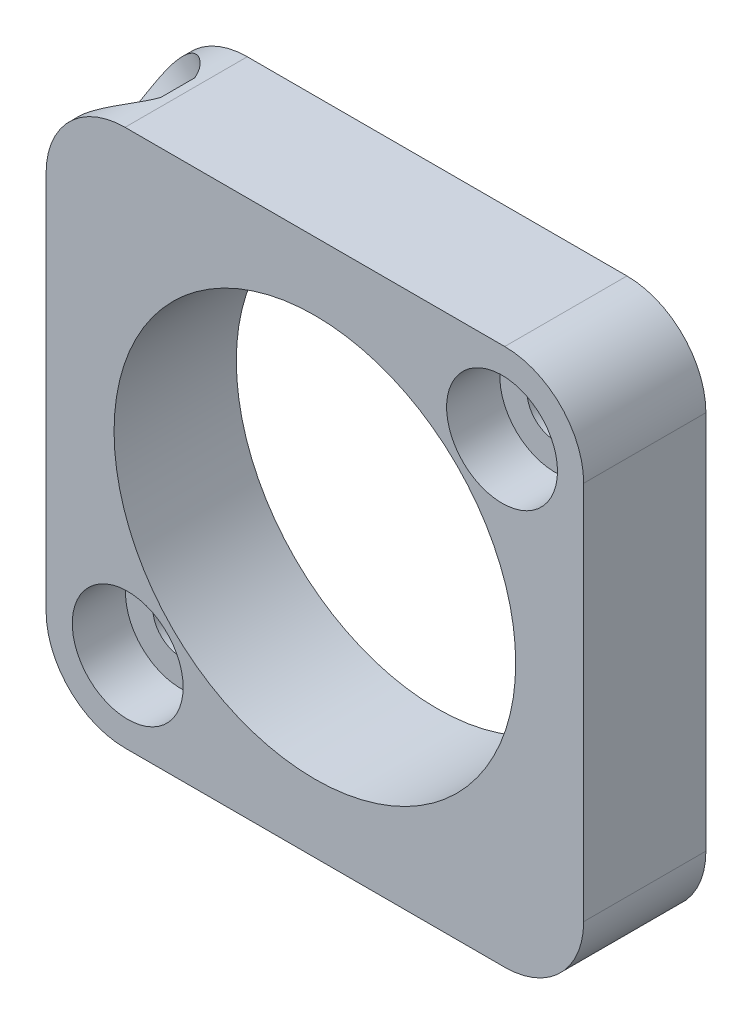
ISO-10303-21;
HEADER;
FILE_DESCRIPTION(('STEP AP214'),'2;1');
FILE_NAME('part.step','',(''),(''),'','','');
FILE_SCHEMA(('AUTOMOTIVE_DESIGN { 1 0 10303 214 1 1 1 1 }'));
ENDSEC;
DATA;
#1=APPLICATION_CONTEXT('core data for automotive mechanical design processes');
#2=APPLICATION_PROTOCOL_DEFINITION('international standard','automotive_design',2000,#1);
#3=PRODUCT_CONTEXT('',#1,'mechanical');
#4=PRODUCT('Part','Part','',(#3));
#5=PRODUCT_RELATED_PRODUCT_CATEGORY('part','',(#4));
#6=PRODUCT_DEFINITION_FORMATION('','',#4);
#7=PRODUCT_DEFINITION_CONTEXT('part definition',#1,'design');
#8=PRODUCT_DEFINITION('design','',#6,#7);
#9=PRODUCT_DEFINITION_SHAPE('','',#8);
#10=(LENGTH_UNIT() NAMED_UNIT(*) SI_UNIT(.MILLI.,.METRE.));
#11=(NAMED_UNIT(*) PLANE_ANGLE_UNIT() SI_UNIT($,.RADIAN.));
#12=(NAMED_UNIT(*) SI_UNIT($,.STERADIAN.) SOLID_ANGLE_UNIT());
#13=UNCERTAINTY_MEASURE_WITH_UNIT(LENGTH_MEASURE(1.E-05),#10,'distance_accuracy_value','');
#14=(GEOMETRIC_REPRESENTATION_CONTEXT(3) GLOBAL_UNCERTAINTY_ASSIGNED_CONTEXT((#13)) GLOBAL_UNIT_ASSIGNED_CONTEXT((#10,
#11,#12)) REPRESENTATION_CONTEXT('',''));
#15=CARTESIAN_POINT('',(0.,0.,0.));
#16=DIRECTION('',(0.,0.,1.));
#17=DIRECTION('',(1.,0.,0.));
#18=AXIS2_PLACEMENT_3D('',#15,#16,#17);
#19=CARTESIAN_POINT('',(0.,5.75,0.));
#20=DIRECTION('',(0.,0.,1.));
#21=DIRECTION('',(1.,0.,0.));
#22=AXIS2_PLACEMENT_3D('',#19,#20,#21);
#23=PLANE('',#22);
#24=CARTESIAN_POINT('',(0.,0.,0.));
#25=DIRECTION('',(0.,0.,1.));
#26=DIRECTION('',(1.,0.,0.));
#27=AXIS2_PLACEMENT_3D('',#24,#25,#26);
#28=CIRCLE('',#27,5.75);
#29=CARTESIAN_POINT('',(5.75,0.,0.));
#30=VERTEX_POINT('',#29);
#31=EDGE_CURVE('E188',#30,#30,#28,.T.);
#32=ORIENTED_EDGE('',*,*,#31,.T.);
#33=EDGE_LOOP('',(#32));
#34=FACE_BOUND('',#33,.T.);
#35=CARTESIAN_POINT('',(-5.35939999916395,-5.35939999916393,0.));
#36=DIRECTION('',(0.,0.,1.));
#37=DIRECTION('',(1.,0.,0.));
#38=AXIS2_PLACEMENT_3D('',#35,#36,#37);
#39=CIRCLE('',#38,1.44145);
#40=CARTESIAN_POINT('',(-3.91794999916395,-5.35939999916393,0.));
#41=VERTEX_POINT('',#40);
#42=EDGE_CURVE('E173',#41,#41,#39,.T.);
#43=ORIENTED_EDGE('',*,*,#42,.T.);
#44=EDGE_LOOP('',(#43));
#45=FACE_BOUND('',#44,.T.);
#46=CARTESIAN_POINT('',(5.35939999916395,5.35939999916392,0.));
#47=DIRECTION('',(0.,0.,1.));
#48=DIRECTION('',(1.,0.,0.));
#49=AXIS2_PLACEMENT_3D('',#46,#47,#48);
#50=CIRCLE('',#49,1.44145);
#51=CARTESIAN_POINT('',(6.80084999916395,5.35939999916392,0.));
#52=VERTEX_POINT('',#51);
#53=EDGE_CURVE('E158',#52,#52,#50,.T.);
#54=ORIENTED_EDGE('',*,*,#53,.T.);
#55=EDGE_LOOP('',(#54));
#56=FACE_BOUND('',#55,.T.);
#57=DIRECTION('',(0.,1.,0.));
#58=VECTOR('',#57,1.);
#59=CARTESIAN_POINT('',(7.6962,5.75,0.));
#60=LINE('',#59,#58);
#61=CARTESIAN_POINT('',(7.6962,-5.4356,0.));
#62=VERTEX_POINT('',#61);
#63=CARTESIAN_POINT('',(7.6962,5.4356,0.));
#64=VERTEX_POINT('',#63);
#65=EDGE_CURVE('E150',#62,#64,#60,.T.);
#66=ORIENTED_EDGE('',*,*,#65,.F.);
#67=CARTESIAN_POINT('',(5.4356,-5.4356,0.));
#68=DIRECTION('',(0.,0.,1.));
#69=DIRECTION('',(1.,0.,0.));
#70=AXIS2_PLACEMENT_3D('',#67,#68,#69);
#71=CIRCLE('',#70,2.2606);
#72=CARTESIAN_POINT('',(5.4356,-7.6962,0.));
#73=VERTEX_POINT('',#72);
#74=EDGE_CURVE('E217',#62,#73,#71,.F.);
#75=ORIENTED_EDGE('',*,*,#74,.T.);
#76=DIRECTION('',(1.,0.,0.));
#77=VECTOR('',#76,1.);
#78=CARTESIAN_POINT('',(0.,-7.6962,0.));
#79=LINE('',#78,#77);
#80=CARTESIAN_POINT('',(-5.4356,-7.6962,0.));
#81=VERTEX_POINT('',#80);
#82=EDGE_CURVE('E147',#81,#73,#79,.T.);
#83=ORIENTED_EDGE('',*,*,#82,.F.);
#84=CARTESIAN_POINT('',(-5.4356,-5.4356,0.));
#85=DIRECTION('',(0.,0.,1.));
#86=DIRECTION('',(1.,0.,0.));
#87=AXIS2_PLACEMENT_3D('',#84,#85,#86);
#88=CIRCLE('',#87,2.2606);
#89=CARTESIAN_POINT('',(-7.6962,-5.4356,0.));
#90=VERTEX_POINT('',#89);
#91=EDGE_CURVE('E215',#81,#90,#88,.F.);
#92=ORIENTED_EDGE('',*,*,#91,.T.);
#93=DIRECTION('',(0.,-1.,0.));
#94=VECTOR('',#93,1.);
#95=CARTESIAN_POINT('',(-7.6962,5.75,0.));
#96=LINE('',#95,#94);
#97=CARTESIAN_POINT('',(-7.6962,5.4356,0.));
#98=VERTEX_POINT('',#97);
#99=EDGE_CURVE('E155',#98,#90,#96,.T.);
#100=ORIENTED_EDGE('',*,*,#99,.F.);
#101=CARTESIAN_POINT('',(-5.4356,5.4356,0.));
#102=DIRECTION('',(0.,0.,1.));
#103=DIRECTION('',(1.,0.,0.));
#104=AXIS2_PLACEMENT_3D('',#101,#102,#103);
#105=CIRCLE('',#104,2.2606);
#106=CARTESIAN_POINT('',(-5.4356,7.6962,0.));
#107=VERTEX_POINT('',#106);
#108=EDGE_CURVE('E58',#98,#107,#105,.F.);
#109=ORIENTED_EDGE('',*,*,#108,.T.);
#110=DIRECTION('',(-1.,0.,0.));
#111=VECTOR('',#110,1.);
#112=CARTESIAN_POINT('',(0.,7.6962,0.));
#113=LINE('',#112,#111);
#114=CARTESIAN_POINT('',(5.4356,7.6962,0.));
#115=VERTEX_POINT('',#114);
#116=EDGE_CURVE('E153',#115,#107,#113,.T.);
#117=ORIENTED_EDGE('',*,*,#116,.F.);
#118=CARTESIAN_POINT('',(5.4356,5.4356,0.));
#119=DIRECTION('',(0.,0.,1.));
#120=DIRECTION('',(1.,0.,0.));
#121=AXIS2_PLACEMENT_3D('',#118,#119,#120);
#122=CIRCLE('',#121,2.2606);
#123=EDGE_CURVE('E212',#115,#64,#122,.F.);
#124=ORIENTED_EDGE('',*,*,#123,.T.);
#125=EDGE_LOOP('',(#66,#75,#83,#92,#100,#109,#117,#124));
#126=FACE_BOUND('',#125,.T.);
#127=ADVANCED_FACE('F35',(#34,#45,#56,#126),#23,.F.);
#128=CARTESIAN_POINT('',(0.,15.,3.5));
#129=DIRECTION('',(0.,0.,-1.));
#130=DIRECTION('',(-1.,0.,0.));
#131=AXIS2_PLACEMENT_3D('',#128,#129,#130);
#132=PLANE('',#131);
#133=CARTESIAN_POINT('',(0.,0.,3.5));
#134=DIRECTION('',(0.,0.,1.));
#135=DIRECTION('',(1.,0.,0.));
#136=AXIS2_PLACEMENT_3D('',#133,#134,#135);
#137=CIRCLE('',#136,5.75);
#138=CARTESIAN_POINT('',(5.75,0.,3.5));
#139=VERTEX_POINT('',#138);
#140=EDGE_CURVE('E191',#139,#139,#137,.T.);
#141=ORIENTED_EDGE('',*,*,#140,.F.);
#142=EDGE_LOOP('',(#141));
#143=FACE_BOUND('',#142,.T.);
#144=CARTESIAN_POINT('',(-5.35939999916395,-5.35939999916393,3.5));
#145=DIRECTION('',(0.,0.,1.));
#146=DIRECTION('',(1.,0.,0.));
#147=AXIS2_PLACEMENT_3D('',#144,#145,#146);
#148=CIRCLE('',#147,1.5875);
#149=CARTESIAN_POINT('',(-3.77189999916395,-5.35939999916393,3.5));
#150=VERTEX_POINT('',#149);
#151=EDGE_CURVE('E176',#150,#150,#148,.T.);
#152=ORIENTED_EDGE('',*,*,#151,.F.);
#153=EDGE_LOOP('',(#152));
#154=FACE_BOUND('',#153,.T.);
#155=CARTESIAN_POINT('',(5.35939999916395,5.35939999916392,3.5));
#156=DIRECTION('',(0.,0.,1.));
#157=DIRECTION('',(1.,0.,0.));
#158=AXIS2_PLACEMENT_3D('',#155,#156,#157);
#159=CIRCLE('',#158,1.5875);
#160=CARTESIAN_POINT('',(6.94689999916395,5.35939999916392,3.5));
#161=VERTEX_POINT('',#160);
#162=EDGE_CURVE('E161',#161,#161,#159,.T.);
#163=ORIENTED_EDGE('',*,*,#162,.F.);
#164=EDGE_LOOP('',(#163));
#165=FACE_BOUND('',#164,.T.);
#166=DIRECTION('',(1.,0.,0.));
#167=VECTOR('',#166,1.);
#168=CARTESIAN_POINT('',(-7.6962,-7.6962,3.5));
#169=LINE('',#168,#167);
#170=CARTESIAN_POINT('',(-5.4356,-7.6962,3.5));
#171=VERTEX_POINT('',#170);
#172=CARTESIAN_POINT('',(5.4356,-7.6962,3.5));
#173=VERTEX_POINT('',#172);
#174=EDGE_CURVE('E129',#171,#173,#169,.T.);
#175=ORIENTED_EDGE('',*,*,#174,.T.);
#176=CARTESIAN_POINT('',(5.4356,-5.4356,3.5));
#177=DIRECTION('',(0.,0.,-1.));
#178=DIRECTION('',(-1.,0.,0.));
#179=AXIS2_PLACEMENT_3D('',#176,#177,#178);
#180=CIRCLE('',#179,2.2606);
#181=CARTESIAN_POINT('',(7.6962,-5.4356,3.5));
#182=VERTEX_POINT('',#181);
#183=EDGE_CURVE('E205',#173,#182,#180,.F.);
#184=ORIENTED_EDGE('',*,*,#183,.T.);
#185=DIRECTION('',(0.,1.,0.));
#186=VECTOR('',#185,1.);
#187=CARTESIAN_POINT('',(7.6962,7.6962,3.5));
#188=LINE('',#187,#186);
#189=CARTESIAN_POINT('',(7.6962,5.4356,3.5));
#190=VERTEX_POINT('',#189);
#191=EDGE_CURVE('E141',#182,#190,#188,.T.);
#192=ORIENTED_EDGE('',*,*,#191,.T.);
#193=CARTESIAN_POINT('',(5.4356,5.4356,3.5));
#194=DIRECTION('',(0.,0.,-1.));
#195=DIRECTION('',(-1.,0.,0.));
#196=AXIS2_PLACEMENT_3D('',#193,#194,#195);
#197=CIRCLE('',#196,2.2606);
#198=CARTESIAN_POINT('',(5.4356,7.6962,3.5));
#199=VERTEX_POINT('',#198);
#200=EDGE_CURVE('E199',#190,#199,#197,.F.);
#201=ORIENTED_EDGE('',*,*,#200,.T.);
#202=DIRECTION('',(-1.,0.,0.));
#203=VECTOR('',#202,1.);
#204=CARTESIAN_POINT('',(-7.6962,7.6962,3.5));
#205=LINE('',#204,#203);
#206=CARTESIAN_POINT('',(-5.4356,7.6962,3.5));
#207=VERTEX_POINT('',#206);
#208=EDGE_CURVE('E144',#199,#207,#205,.T.);
#209=ORIENTED_EDGE('',*,*,#208,.T.);
#210=CARTESIAN_POINT('',(-5.4356,5.4356,3.5));
#211=DIRECTION('',(0.,0.,-1.));
#212=DIRECTION('',(-1.,0.,0.));
#213=AXIS2_PLACEMENT_3D('',#210,#211,#212);
#214=CIRCLE('',#213,2.2606);
#215=CARTESIAN_POINT('',(-7.6962,5.4356,3.5));
#216=VERTEX_POINT('',#215);
#217=EDGE_CURVE('E201',#207,#216,#214,.F.);
#218=ORIENTED_EDGE('',*,*,#217,.T.);
#219=DIRECTION('',(0.,-1.,0.));
#220=VECTOR('',#219,1.);
#221=CARTESIAN_POINT('',(-7.6962,7.6962,3.5));
#222=LINE('',#221,#220);
#223=CARTESIAN_POINT('',(-7.6962,-5.4356,3.5));
#224=VERTEX_POINT('',#223);
#225=EDGE_CURVE('E126',#216,#224,#222,.T.);
#226=ORIENTED_EDGE('',*,*,#225,.T.);
#227=CARTESIAN_POINT('',(-5.4356,-5.4356,3.5));
#228=DIRECTION('',(0.,0.,-1.));
#229=DIRECTION('',(-1.,0.,0.));
#230=AXIS2_PLACEMENT_3D('',#227,#228,#229);
#231=CIRCLE('',#230,2.2606);
#232=EDGE_CURVE('E203',#224,#171,#231,.F.);
#233=ORIENTED_EDGE('',*,*,#232,.T.);
#234=EDGE_LOOP('',(#175,#184,#192,#201,#209,#218,#226,#233));
#235=FACE_BOUND('',#234,.T.);
#236=ADVANCED_FACE('F297',(#143,#154,#165,#235),#132,.F.);
#237=CARTESIAN_POINT('',(0.,0.,0.));
#238=DIRECTION('',(0.,0.,1.));
#239=DIRECTION('',(1.,0.,0.));
#240=AXIS2_PLACEMENT_3D('',#237,#238,#239);
#241=CYLINDRICAL_SURFACE('',#240,5.75);
#242=CARTESIAN_POINT('',(-4.64559309643393,3.38835723948425,1.75));
#243=CARTESIAN_POINT('',(-4.64559225748131,3.38835927889538,1.79961428160127));
#244=CARTESIAN_POINT('',(-4.64311084036011,3.39176863705336,1.8492569100176));
#245=CARTESIAN_POINT('',(-4.63321514723789,3.40527308647253,1.9471529006297));
#246=CARTESIAN_POINT('',(-4.6257961296468,3.4153746041886,1.99540488086897));
#247=CARTESIAN_POINT('',(-4.60613892464953,3.44183876247575,2.08908845166155));
#248=CARTESIAN_POINT('',(-4.59390452306584,3.45819648417631,2.13452222546536));
#249=CARTESIAN_POINT('',(-4.5647998059507,3.49652385633229,2.22134650809414));
#250=CARTESIAN_POINT('',(-4.5479300974749,3.51849277190003,2.26273754540823));
#251=CARTESIAN_POINT('',(-4.50966676812324,3.56740442139802,2.34065918292924));
#252=CARTESIAN_POINT('',(-4.48823973255348,3.59438369541901,2.37715044360766));
#253=CARTESIAN_POINT('',(-4.44129760660957,3.65222674738696,2.44389555512867));
#254=CARTESIAN_POINT('',(-4.41578228703176,3.68309074310436,2.47414905604279));
#255=CARTESIAN_POINT('',(-4.36100010269594,3.74779688231351,2.5277056985334));
#256=CARTESIAN_POINT('',(-4.33171472116034,3.78165344785836,2.55097250750289));
#257=CARTESIAN_POINT('',(-4.27012589755769,3.85106153247424,2.58966204917127));
#258=CARTESIAN_POINT('',(-4.23782262483017,3.88661295638884,2.60508522167873));
#259=CARTESIAN_POINT('',(-4.1712538198805,3.95796692507965,2.62753013532129));
#260=CARTESIAN_POINT('',(-4.13700596682285,3.99376521411752,2.6346178167372));
#261=CARTESIAN_POINT('',(-4.0672385276346,4.06479373120706,2.64039538333212));
#262=CARTESIAN_POINT('',(-4.03171901652076,4.10002399259017,2.63908576306979));
#263=CARTESIAN_POINT('',(-3.96075236733247,4.16861563774769,2.62815777577604));
#264=CARTESIAN_POINT('',(-3.92530719497928,4.20199039641057,2.61861035627621));
#265=CARTESIAN_POINT('',(-3.85527065349667,4.26633932934866,2.59158924542486));
#266=CARTESIAN_POINT('',(-3.82067930747207,4.29731343870992,2.57411533982734));
#267=CARTESIAN_POINT('',(-3.75331992620705,4.35627169449676,2.53166521266802));
#268=CARTESIAN_POINT('',(-3.72055972876132,4.38424339922229,2.50665929266481));
#269=CARTESIAN_POINT('',(-3.65810178978597,4.43649093505464,2.44987666539377));
#270=CARTESIAN_POINT('',(-3.62840426242718,4.46076650774946,2.41809948509125));
#271=CARTESIAN_POINT('',(-3.57281049164618,4.50542032157976,2.34828159892733));
#272=CARTESIAN_POINT('',(-3.5469571972715,4.52575520199311,2.31017893142298));
#273=CARTESIAN_POINT('',(-3.5003833002081,4.56187330683561,2.22900171474623));
#274=CARTESIAN_POINT('',(-3.47966273298408,4.5776564998149,2.18592713122327));
#275=CARTESIAN_POINT('',(-3.44414538460091,4.60443918448082,2.09596329233842));
#276=CARTESIAN_POINT('',(-3.42935373554844,4.61543453248827,2.0490707742042));
#277=CARTESIAN_POINT('',(-3.40632821158281,4.63245454136745,1.95283797144094));
#278=CARTESIAN_POINT('',(-3.39809384410772,4.6384795755944,1.90349787096224));
#279=CARTESIAN_POINT('',(-3.38858131687238,4.64543340613135,1.80431429828374));
#280=CARTESIAN_POINT('',(-3.38723243667512,4.64641401426056,1.75448123300892));
#281=CARTESIAN_POINT('',(-3.39135691999996,4.64340440913189,1.65525090312994));
#282=CARTESIAN_POINT('',(-3.39683005813271,4.63941436009711,1.60585362418235));
#283=CARTESIAN_POINT('',(-3.41431997825929,4.62655753725161,1.50916730772656));
#284=CARTESIAN_POINT('',(-3.42630157867328,4.61771698036612,1.46186840106937));
#285=CARTESIAN_POINT('',(-3.4563002151479,4.59530600617718,1.37040970151373));
#286=CARTESIAN_POINT('',(-3.47431756628135,4.58173534195546,1.32625007263493));
#287=CARTESIAN_POINT('',(-3.51585755254301,4.54993765977729,1.2419358021436));
#288=CARTESIAN_POINT('',(-3.53942298780948,4.53167433526406,1.20181594626508));
#289=CARTESIAN_POINT('',(-3.59110225129528,4.49083140402485,1.12707821159468));
#290=CARTESIAN_POINT('',(-3.61921635329527,4.46825153747474,1.09246066423121));
#291=CARTESIAN_POINT('',(-3.67926155042652,4.41894264037713,1.02939765592913));
#292=CARTESIAN_POINT('',(-3.71122431342017,4.39217855720355,1.00100971217083));
#293=CARTESIAN_POINT('',(-3.77765526795949,4.33517399763997,0.951613040027719));
#294=CARTESIAN_POINT('',(-3.81212338748714,4.30493362116366,0.930604099630054));
#295=CARTESIAN_POINT('',(-3.88227572768634,4.24177465191687,0.896653066272823));
#296=CARTESIAN_POINT('',(-3.91795469141029,4.20886694431032,0.883679885953335));
#297=CARTESIAN_POINT('',(-3.98951403995529,4.14109941866725,0.866068154166709));
#298=CARTESIAN_POINT('',(-4.02539441042798,4.10623973814178,0.86142901634938));
#299=CARTESIAN_POINT('',(-4.09590041443922,4.03590805154726,0.860632052136348));
#300=CARTESIAN_POINT('',(-4.13053522666007,4.00044621107322,0.864386352772234));
#301=CARTESIAN_POINT('',(-4.19798612507494,3.9296062536833,0.880080886765646));
#302=CARTESIAN_POINT('',(-4.23080221817861,3.89422813644983,0.892021089021118));
#303=CARTESIAN_POINT('',(-4.2937722394883,3.82468566757309,0.923716622366501));
#304=CARTESIAN_POINT('',(-4.32392834210181,3.79052033845003,0.943465496475751));
#305=CARTESIAN_POINT('',(-4.38094631940841,3.72447514581284,0.990208301291966));
#306=CARTESIAN_POINT('',(-4.40780807376693,3.69259536580195,1.01720249653821));
#307=CARTESIAN_POINT('',(-4.45796572784738,3.63188789917179,1.07798577906956));
#308=CARTESIAN_POINT('',(-4.48122361339823,3.60309362426805,1.11183961150181));
#309=CARTESIAN_POINT('',(-4.52344723121114,3.5499409053437,1.18524498061718));
#310=CARTESIAN_POINT('',(-4.5424119557637,3.52558350302674,1.22479785144551));
#311=CARTESIAN_POINT('',(-4.57583973208957,3.48208987779873,1.30875830517927));
#312=CARTESIAN_POINT('',(-4.5902751037433,3.46298584408624,1.35319358074));
#313=CARTESIAN_POINT('',(-4.61425556307721,3.43096913228103,1.44544773969475));
#314=CARTESIAN_POINT('',(-4.62380567587669,3.41805009300386,1.49326308837089));
#315=CARTESIAN_POINT('',(-4.63575188486805,3.40181862650726,1.57607150543014));
#316=CARTESIAN_POINT('',(-4.63943921365861,3.39678102224442,1.61055567556009));
#317=CARTESIAN_POINT('',(-4.64436009784644,3.39004963328796,1.68002186731974));
#318=CARTESIAN_POINT('',(-4.64559368820075,3.38835580095747,1.71500388184977));
#319=CARTESIAN_POINT('',(-4.64559309643393,3.38835723948425,1.75));
#320=B_SPLINE_CURVE_WITH_KNOTS('',3,(#242,#243,#244,#245,#246,#247,#248,#249,#250,#251,#252,
#253,#254,#255,#256,#257,#258,#259,#260,#261,#262,#263,#264,#265,#266,#267,#268,#269,#270,#271,
#272,#273,#274,#275,#276,#277,#278,#279,#280,#281,#282,#283,#284,#285,#286,#287,#288,#289,#290,
#291,#292,#293,#294,#295,#296,#297,#298,#299,#300,#301,#302,#303,#304,#305,#306,#307,#308,#309,
#310,#311,#312,#313,#314,#315,#316,#317,#318,#319),.UNSPECIFIED.,.T.,.F.,(4,2,2,2,2,2,2,2,2,2,2,
2,2,2,2,2,2,2,2,2,2,2,2,2,2,2,2,2,2,2,2,2,2,2,2,2,2,2,4),(0.,0.148714914511963,
0.297572846789098,0.446313980980967,0.595035644801657,0.744887849555668,0.894748458495968,
1.04537539781606,1.1959938902471,1.34541268154885,1.49482267291944,1.64295858026905,
1.79109849184148,1.93983033449343,2.08857257083823,2.23886857778596,2.38916562317867,
2.53959248707932,2.6900080503313,2.83887555046408,2.98773813236653,3.13580392899622,
3.28387745602768,3.43313304469118,3.5823976202754,3.73298721017959,3.88357247300341,
4.0335714783849,4.18355993001766,4.33198547686391,4.48041045977547,4.62871296607378,
4.77702088789135,4.92679993472296,5.07661410197784,5.22732675359211,5.37788406447001,
5.48278367598119,5.58768179303523),.UNSPECIFIED.);
#321=CARTESIAN_POINT('',(-4.64559309643393,3.38835723948425,1.75));
#322=VERTEX_POINT('',#321);
#323=EDGE_CURVE('E131',#322,#322,#320,.T.);
#324=ORIENTED_EDGE('',*,*,#323,.T.);
#325=EDGE_LOOP('',(#324));
#326=FACE_BOUND('',#325,.T.);
#327=ORIENTED_EDGE('',*,*,#31,.F.);
#328=EDGE_LOOP('',(#327));
#329=FACE_BOUND('',#328,.T.);
#330=ORIENTED_EDGE('',*,*,#140,.T.);
#331=EDGE_LOOP('',(#330));
#332=FACE_BOUND('',#331,.T.);
#333=ADVANCED_FACE('F293',(#326,#329,#332),#241,.F.);
#334=CARTESIAN_POINT('',(-5.35939999916395,-5.35939999916393,0.635));
#335=DIRECTION('',(0.,0.,-1.));
#336=DIRECTION('',(-1.,0.,0.));
#337=AXIS2_PLACEMENT_3D('',#334,#335,#336);
#338=CONICAL_SURFACE('',#337,0.806449999999999,0.785398163397448);
#339=ORIENTED_EDGE('',*,*,#42,.F.);
#340=EDGE_LOOP('',(#339));
#341=FACE_BOUND('',#340,.T.);
#342=CARTESIAN_POINT('',(-5.35939999916395,-5.35939999916393,0.635));
#343=DIRECTION('',(0.,0.,1.));
#344=DIRECTION('',(1.,0.,0.));
#345=AXIS2_PLACEMENT_3D('',#342,#343,#344);
#346=CIRCLE('',#345,0.806449999999999);
#347=CARTESIAN_POINT('',(-4.55294999916395,-5.35939999916393,0.635));
#348=VERTEX_POINT('',#347);
#349=EDGE_CURVE('E185',#348,#348,#346,.T.);
#350=ORIENTED_EDGE('',*,*,#349,.T.);
#351=EDGE_LOOP('',(#350));
#352=FACE_BOUND('',#351,.T.);
#353=ADVANCED_FACE('F289',(#341,#352),#338,.F.);
#354=CARTESIAN_POINT('',(-5.35939999916395,-5.35939999916393,3.5));
#355=DIRECTION('',(0.,0.,1.));
#356=DIRECTION('',(1.,0.,0.));
#357=AXIS2_PLACEMENT_3D('',#354,#355,#356);
#358=CYLINDRICAL_SURFACE('',#357,0.806449999999999);
#359=ORIENTED_EDGE('',*,*,#349,.F.);
#360=EDGE_LOOP('',(#359));
#361=FACE_BOUND('',#360,.T.);
#362=CARTESIAN_POINT('',(-5.35939999916395,-5.35939999916393,1.976));
#363=DIRECTION('',(0.,0.,1.));
#364=DIRECTION('',(1.,0.,0.));
#365=AXIS2_PLACEMENT_3D('',#362,#363,#364);
#366=CIRCLE('',#365,0.806449999999999);
#367=CARTESIAN_POINT('',(-4.55294999916395,-5.35939999916393,1.976));
#368=VERTEX_POINT('',#367);
#369=EDGE_CURVE('E182',#368,#368,#366,.T.);
#370=ORIENTED_EDGE('',*,*,#369,.T.);
#371=EDGE_LOOP('',(#370));
#372=FACE_BOUND('',#371,.T.);
#373=ADVANCED_FACE('F285',(#361,#372),#358,.F.);
#374=CARTESIAN_POINT('',(-4.55294999916395,-5.35939999916393,1.976));
#375=DIRECTION('',(0.,0.,-1.));
#376=DIRECTION('',(-1.,0.,0.));
#377=AXIS2_PLACEMENT_3D('',#374,#375,#376);
#378=PLANE('',#377);
#379=ORIENTED_EDGE('',*,*,#369,.F.);
#380=EDGE_LOOP('',(#379));
#381=FACE_BOUND('',#380,.T.);
#382=CARTESIAN_POINT('',(-5.35939999916395,-5.35939999916393,1.976));
#383=DIRECTION('',(0.,0.,1.));
#384=DIRECTION('',(1.,0.,0.));
#385=AXIS2_PLACEMENT_3D('',#382,#383,#384);
#386=CIRCLE('',#385,1.5875);
#387=CARTESIAN_POINT('',(-3.77189999916395,-5.35939999916393,1.976));
#388=VERTEX_POINT('',#387);
#389=EDGE_CURVE('E179',#388,#388,#386,.T.);
#390=ORIENTED_EDGE('',*,*,#389,.T.);
#391=EDGE_LOOP('',(#390));
#392=FACE_BOUND('',#391,.T.);
#393=ADVANCED_FACE('F281',(#381,#392),#378,.F.);
#394=CARTESIAN_POINT('',(-5.35939999916395,-5.35939999916393,3.5));
#395=DIRECTION('',(0.,0.,1.));
#396=DIRECTION('',(1.,0.,0.));
#397=AXIS2_PLACEMENT_3D('',#394,#395,#396);
#398=CYLINDRICAL_SURFACE('',#397,1.5875);
#399=ORIENTED_EDGE('',*,*,#389,.F.);
#400=EDGE_LOOP('',(#399));
#401=FACE_BOUND('',#400,.T.);
#402=ORIENTED_EDGE('',*,*,#151,.T.);
#403=EDGE_LOOP('',(#402));
#404=FACE_BOUND('',#403,.T.);
#405=ADVANCED_FACE('F277',(#401,#404),#398,.F.);
#406=CARTESIAN_POINT('',(5.35939999916395,5.35939999916392,0.635));
#407=DIRECTION('',(0.,0.,-1.));
#408=DIRECTION('',(-1.,0.,0.));
#409=AXIS2_PLACEMENT_3D('',#406,#407,#408);
#410=CONICAL_SURFACE('',#409,0.806449999999999,0.785398163397448);
#411=ORIENTED_EDGE('',*,*,#53,.F.);
#412=EDGE_LOOP('',(#411));
#413=FACE_BOUND('',#412,.T.);
#414=CARTESIAN_POINT('',(5.35939999916395,5.35939999916392,0.635));
#415=DIRECTION('',(0.,0.,1.));
#416=DIRECTION('',(1.,0.,0.));
#417=AXIS2_PLACEMENT_3D('',#414,#415,#416);
#418=CIRCLE('',#417,0.806449999999999);
#419=CARTESIAN_POINT('',(6.16584999916395,5.35939999916392,0.635));
#420=VERTEX_POINT('',#419);
#421=EDGE_CURVE('E170',#420,#420,#418,.T.);
#422=ORIENTED_EDGE('',*,*,#421,.T.);
#423=EDGE_LOOP('',(#422));
#424=FACE_BOUND('',#423,.T.);
#425=ADVANCED_FACE('F273',(#413,#424),#410,.F.);
#426=CARTESIAN_POINT('',(5.35939999916395,5.35939999916392,3.5));
#427=DIRECTION('',(0.,0.,1.));
#428=DIRECTION('',(1.,0.,0.));
#429=AXIS2_PLACEMENT_3D('',#426,#427,#428);
#430=CYLINDRICAL_SURFACE('',#429,0.806449999999999);
#431=ORIENTED_EDGE('',*,*,#421,.F.);
#432=EDGE_LOOP('',(#431));
#433=FACE_BOUND('',#432,.T.);
#434=CARTESIAN_POINT('',(5.35939999916395,5.35939999916392,1.976));
#435=DIRECTION('',(0.,0.,1.));
#436=DIRECTION('',(1.,0.,0.));
#437=AXIS2_PLACEMENT_3D('',#434,#435,#436);
#438=CIRCLE('',#437,0.806449999999999);
#439=CARTESIAN_POINT('',(6.16584999916395,5.35939999916392,1.976));
#440=VERTEX_POINT('',#439);
#441=EDGE_CURVE('E167',#440,#440,#438,.T.);
#442=ORIENTED_EDGE('',*,*,#441,.T.);
#443=EDGE_LOOP('',(#442));
#444=FACE_BOUND('',#443,.T.);
#445=ADVANCED_FACE('F269',(#433,#444),#430,.F.);
#446=CARTESIAN_POINT('',(6.16584999916395,5.35939999916392,1.976));
#447=DIRECTION('',(0.,0.,-1.));
#448=DIRECTION('',(-1.,0.,0.));
#449=AXIS2_PLACEMENT_3D('',#446,#447,#448);
#450=PLANE('',#449);
#451=ORIENTED_EDGE('',*,*,#441,.F.);
#452=EDGE_LOOP('',(#451));
#453=FACE_BOUND('',#452,.T.);
#454=CARTESIAN_POINT('',(5.35939999916395,5.35939999916392,1.976));
#455=DIRECTION('',(0.,0.,1.));
#456=DIRECTION('',(1.,0.,0.));
#457=AXIS2_PLACEMENT_3D('',#454,#455,#456);
#458=CIRCLE('',#457,1.5875);
#459=CARTESIAN_POINT('',(6.94689999916395,5.35939999916392,1.976));
#460=VERTEX_POINT('',#459);
#461=EDGE_CURVE('E164',#460,#460,#458,.T.);
#462=ORIENTED_EDGE('',*,*,#461,.T.);
#463=EDGE_LOOP('',(#462));
#464=FACE_BOUND('',#463,.T.);
#465=ADVANCED_FACE('F265',(#453,#464),#450,.F.);
#466=CARTESIAN_POINT('',(5.35939999916395,5.35939999916392,3.5));
#467=DIRECTION('',(0.,0.,1.));
#468=DIRECTION('',(1.,0.,0.));
#469=AXIS2_PLACEMENT_3D('',#466,#467,#468);
#470=CYLINDRICAL_SURFACE('',#469,1.5875);
#471=ORIENTED_EDGE('',*,*,#461,.F.);
#472=EDGE_LOOP('',(#471));
#473=FACE_BOUND('',#472,.T.);
#474=ORIENTED_EDGE('',*,*,#162,.T.);
#475=EDGE_LOOP('',(#474));
#476=FACE_BOUND('',#475,.T.);
#477=ADVANCED_FACE('F261',(#473,#476),#470,.F.);
#478=CARTESIAN_POINT('',(-7.6962,7.6962,-6.5));
#479=DIRECTION('',(-1.,0.,0.));
#480=DIRECTION('',(0.,-1.,0.));
#481=AXIS2_PLACEMENT_3D('',#478,#479,#480);
#482=PLANE('',#481);
#483=ORIENTED_EDGE('',*,*,#99,.T.);
#484=DIRECTION('',(0.,0.,1.));
#485=VECTOR('',#484,1.);
#486=CARTESIAN_POINT('',(-7.6962,-5.4356,-6.5));
#487=LINE('',#486,#485);
#488=EDGE_CURVE('E221',#90,#224,#487,.T.);
#489=ORIENTED_EDGE('',*,*,#488,.T.);
#490=ORIENTED_EDGE('',*,*,#225,.F.);
#491=DIRECTION('',(0.,0.,1.));
#492=VECTOR('',#491,1.);
#493=CARTESIAN_POINT('',(-7.6962,5.4356,-6.5));
#494=LINE('',#493,#492);
#495=EDGE_CURVE('E219',#216,#98,#494,.F.);
#496=ORIENTED_EDGE('',*,*,#495,.T.);
#497=EDGE_LOOP('',(#483,#489,#490,#496));
#498=FACE_BOUND('',#497,.T.);
#499=ADVANCED_FACE('F249',(#498),#482,.T.);
#500=CARTESIAN_POINT('',(-7.6962,7.6962,-6.5));
#501=DIRECTION('',(0.,1.,0.));
#502=DIRECTION('',(0.,0.,1.));
#503=AXIS2_PLACEMENT_3D('',#500,#501,#502);
#504=PLANE('',#503);
#505=ORIENTED_EDGE('',*,*,#116,.T.);
#506=DIRECTION('',(0.,0.,1.));
#507=VECTOR('',#506,1.);
#508=CARTESIAN_POINT('',(-5.4356,7.6962,-6.5));
#509=LINE('',#508,#507);
#510=EDGE_CURVE('E226',#107,#207,#509,.T.);
#511=ORIENTED_EDGE('',*,*,#510,.T.);
#512=ORIENTED_EDGE('',*,*,#208,.F.);
#513=DIRECTION('',(0.,0.,1.));
#514=VECTOR('',#513,1.);
#515=CARTESIAN_POINT('',(5.4356,7.6962,-6.5));
#516=LINE('',#515,#514);
#517=EDGE_CURVE('E224',#199,#115,#516,.F.);
#518=ORIENTED_EDGE('',*,*,#517,.T.);
#519=EDGE_LOOP('',(#505,#511,#512,#518));
#520=FACE_BOUND('',#519,.T.);
#521=ADVANCED_FACE('F244',(#520),#504,.T.);
#522=CARTESIAN_POINT('',(7.6962,7.6962,-6.5));
#523=DIRECTION('',(1.,0.,0.));
#524=DIRECTION('',(0.,1.,0.));
#525=AXIS2_PLACEMENT_3D('',#522,#523,#524);
#526=PLANE('',#525);
#527=ORIENTED_EDGE('',*,*,#191,.F.);
#528=DIRECTION('',(0.,0.,1.));
#529=VECTOR('',#528,1.);
#530=CARTESIAN_POINT('',(7.6962,-5.4356,-6.5));
#531=LINE('',#530,#529);
#532=EDGE_CURVE('E210',#182,#62,#531,.F.);
#533=ORIENTED_EDGE('',*,*,#532,.T.);
#534=ORIENTED_EDGE('',*,*,#65,.T.);
#535=DIRECTION('',(0.,0.,1.));
#536=VECTOR('',#535,1.);
#537=CARTESIAN_POINT('',(7.6962,5.4356,-6.5));
#538=LINE('',#537,#536);
#539=EDGE_CURVE('E207',#64,#190,#538,.T.);
#540=ORIENTED_EDGE('',*,*,#539,.T.);
#541=EDGE_LOOP('',(#527,#533,#534,#540));
#542=FACE_BOUND('',#541,.T.);
#543=ADVANCED_FACE('F248',(#542),#526,.T.);
#544=CARTESIAN_POINT('',(-7.6962,-7.6962,-6.5));
#545=DIRECTION('',(0.,-1.,0.));
#546=DIRECTION('',(1.,0.,0.));
#547=AXIS2_PLACEMENT_3D('',#544,#545,#546);
#548=PLANE('',#547);
#549=ORIENTED_EDGE('',*,*,#82,.T.);
#550=DIRECTION('',(0.,0.,1.));
#551=VECTOR('',#550,1.);
#552=CARTESIAN_POINT('',(5.4356,-7.6962,-6.5));
#553=LINE('',#552,#551);
#554=EDGE_CURVE('E196',#73,#173,#553,.T.);
#555=ORIENTED_EDGE('',*,*,#554,.T.);
#556=ORIENTED_EDGE('',*,*,#174,.F.);
#557=DIRECTION('',(0.,0.,1.));
#558=VECTOR('',#557,1.);
#559=CARTESIAN_POINT('',(-5.4356,-7.6962,-6.5));
#560=LINE('',#559,#558);
#561=EDGE_CURVE('E194',#171,#81,#560,.F.);
#562=ORIENTED_EDGE('',*,*,#561,.T.);
#563=EDGE_LOOP('',(#549,#555,#556,#562));
#564=FACE_BOUND('',#563,.T.);
#565=ADVANCED_FACE('F253',(#564),#548,.T.);
#566=CARTESIAN_POINT('',(5.4356,-5.4356,-6.5));
#567=DIRECTION('',(0.,0.,1.));
#568=DIRECTION('',(1.,0.,0.));
#569=AXIS2_PLACEMENT_3D('',#566,#567,#568);
#570=CYLINDRICAL_SURFACE('',#569,2.2606);
#571=ORIENTED_EDGE('',*,*,#74,.F.);
#572=ORIENTED_EDGE('',*,*,#532,.F.);
#573=ORIENTED_EDGE('',*,*,#183,.F.);
#574=ORIENTED_EDGE('',*,*,#554,.F.);
#575=EDGE_LOOP('',(#571,#572,#573,#574));
#576=FACE_BOUND('',#575,.T.);
#577=ADVANCED_FACE('F257',(#576),#570,.T.);
#578=CARTESIAN_POINT('',(-5.4356,-5.4356,-6.5));
#579=DIRECTION('',(0.,0.,1.));
#580=DIRECTION('',(1.,0.,0.));
#581=AXIS2_PLACEMENT_3D('',#578,#579,#580);
#582=CYLINDRICAL_SURFACE('',#581,2.2606);
#583=ORIENTED_EDGE('',*,*,#91,.F.);
#584=ORIENTED_EDGE('',*,*,#561,.F.);
#585=ORIENTED_EDGE('',*,*,#232,.F.);
#586=ORIENTED_EDGE('',*,*,#488,.F.);
#587=EDGE_LOOP('',(#583,#584,#585,#586));
#588=FACE_BOUND('',#587,.T.);
#589=ADVANCED_FACE('F306',(#588),#582,.T.);
#590=CARTESIAN_POINT('',(-5.4356,5.4356,-6.5));
#591=DIRECTION('',(0.,0.,1.));
#592=DIRECTION('',(1.,0.,0.));
#593=AXIS2_PLACEMENT_3D('',#590,#591,#592);
#594=CYLINDRICAL_SURFACE('',#593,2.2606);
#595=CARTESIAN_POINT('',(-7.68317869698114,5.67788570093293,2.239285192909));
#596=CARTESIAN_POINT('',(-7.6811889606837,5.69633618676867,2.28115651934436));
#597=CARTESIAN_POINT('',(-7.6787547869528,5.71679287615149,2.32206552608541));
#598=CARTESIAN_POINT('',(-7.67274431375797,5.76117677903302,2.40181551931472));
#599=CARTESIAN_POINT('',(-7.66916923423358,5.7851002707256,2.4406586632512));
#600=CARTESIAN_POINT('',(-7.65634927978082,5.86130774052948,2.55397833140387));
#601=CARTESIAN_POINT('',(-7.64500862622126,5.9180427146689,2.6252753141374));
#602=CARTESIAN_POINT('',(-7.61490535109265,6.03963739877611,2.75823889629359));
#603=CARTESIAN_POINT('',(-7.59616744716514,6.10446956402546,2.81993662373705));
#604=CARTESIAN_POINT('',(-7.54956599564886,6.23969116111268,2.93297153525405));
#605=CARTESIAN_POINT('',(-7.52170759204731,6.31007744346853,2.9843145331066));
#606=CARTESIAN_POINT('',(-7.46005820901223,6.44383701177479,3.06881697136372));
#607=CARTESIAN_POINT('',(-7.42759641954937,6.50685582068728,3.10350193290367));
#608=CARTESIAN_POINT('',(-7.35445142720529,6.63293814489959,3.16263275520349));
#609=CARTESIAN_POINT('',(-7.31377472326866,6.69600158583417,3.18708666322376));
#610=CARTESIAN_POINT('',(-7.22416197256493,6.82024880286054,3.22462738234001));
#611=CARTESIAN_POINT('',(-7.1751796504717,6.88141964270308,3.23764783127638));
#612=CARTESIAN_POINT('',(-7.0702875026506,6.99902787577715,3.25122826844014));
#613=CARTESIAN_POINT('',(-7.01438019877186,7.05546697966815,3.25179277937038));
#614=CARTESIAN_POINT('',(-6.9034440130107,7.15630007707829,3.24100819487248));
#615=CARTESIAN_POINT('',(-6.8488748976338,7.20133327206304,3.23083160320202));
#616=CARTESIAN_POINT('',(-6.73751529116861,7.28497276773496,3.2009043553794));
#617=CARTESIAN_POINT('',(-6.6807247427229,7.32357890233993,3.18115345186823));
#618=CARTESIAN_POINT('',(-6.56516431174557,7.39497145520714,3.13232091505219));
#619=CARTESIAN_POINT('',(-6.50638203929731,7.42757516823052,3.10300444481163));
#620=CARTESIAN_POINT('',(-6.39000817958732,7.48588336244617,3.03626017297916));
#621=CARTESIAN_POINT('',(-6.33241750560721,7.51158272043247,2.99882638514791));
#622=CARTESIAN_POINT('',(-6.21177454914077,7.55990577408146,2.91083908604374));
#623=CARTESIAN_POINT('',(-6.14914167411114,7.58154270442501,2.85917016029611));
#624=CARTESIAN_POINT('',(-6.02953805392535,7.61767603390566,2.74752679043121));
#625=CARTESIAN_POINT('',(-5.97256618430326,7.63217385338241,2.68755400142765));
#626=CARTESIAN_POINT('',(-5.87127610926702,7.65436781209602,2.56571720827109));
#627=CARTESIAN_POINT('',(-5.82628032410692,7.66255905911598,2.50451037087847));
#628=CARTESIAN_POINT('',(-5.74499007923956,7.6753120619237,2.37619940480212));
#629=CARTESIAN_POINT('',(-5.70870103096875,7.67987156456152,2.30909164377888));
#630=CARTESIAN_POINT('',(-5.67788570093293,7.68317869698114,2.239285192909));
#631=B_SPLINE_CURVE_WITH_KNOTS('',3,(#595,#596,#597,#598,#599,#600,#601,#602,#603,#604,#605,
#606,#607,#608,#609,#610,#611,#612,#613,#614,#615,#616,#617,#618,#619,#620,#621,#622,#623,#624,
#625,#626,#627,#628,#629,#630),.UNSPECIFIED.,.F.,.F.,(4,2,2,2,2,2,2,2,2,2,2,2,2,2,2,2,2,4),(0.,
0.137256368308186,0.274366461114973,0.548488044284856,0.82170130956267,1.09476074649706,
1.33054094218196,1.56613533412716,1.80308829409862,2.03995521595152,2.2534006216112,
2.46685154207536,2.68599610040931,2.90530282321274,3.15641871150789,3.40748461961595,
3.63593129709198,3.86451959372432),.UNSPECIFIED.);
#632=CARTESIAN_POINT('',(-7.68317869698114,5.67788570093293,2.239285192909));
#633=VERTEX_POINT('',#632);
#634=CARTESIAN_POINT('',(-5.67788570093293,7.68317869698114,2.239285192909));
#635=VERTEX_POINT('',#634);
#636=EDGE_CURVE('E115',#633,#635,#631,.T.);
#637=ORIENTED_EDGE('',*,*,#636,.F.);
#638=DIRECTION('',(0.,0.,1.));
#639=VECTOR('',#638,1.);
#640=CARTESIAN_POINT('',(-7.68317869698114,5.67788570093293,-6.5));
#641=LINE('',#640,#639);
#642=CARTESIAN_POINT('',(-7.68317869698114,5.67788570093293,1.260714807091));
#643=VERTEX_POINT('',#642);
#644=EDGE_CURVE('E12',#633,#643,#641,.F.);
#645=ORIENTED_EDGE('',*,*,#644,.T.);
#646=CARTESIAN_POINT('',(-5.67788570093293,7.68317869698114,1.260714807091));
#647=CARTESIAN_POINT('',(-5.69633618676867,7.6811889606837,1.21884348065564));
#648=CARTESIAN_POINT('',(-5.71679287615149,7.6787547869528,1.17793447391459));
#649=CARTESIAN_POINT('',(-5.76117677903302,7.67274431375797,1.09818448068528));
#650=CARTESIAN_POINT('',(-5.7851002707256,7.66916923423358,1.0593413367488));
#651=CARTESIAN_POINT('',(-5.86130774052949,7.65634927978081,0.946021668596133));
#652=CARTESIAN_POINT('',(-5.9180427146689,7.64500862622126,0.874724685862596));
#653=CARTESIAN_POINT('',(-6.03963739877611,7.61490535109265,0.74176110370641));
#654=CARTESIAN_POINT('',(-6.10446956402546,7.59616744716514,0.68006337626295));
#655=CARTESIAN_POINT('',(-6.23969116111268,7.54956599564886,0.567028464745954));
#656=CARTESIAN_POINT('',(-6.31007744346853,7.52170759204731,0.515685466893405));
#657=CARTESIAN_POINT('',(-6.44383701177479,7.46005820901223,0.431183028636277));
#658=CARTESIAN_POINT('',(-6.50685582068728,7.42759641954937,0.396498067096336));
#659=CARTESIAN_POINT('',(-6.63293814489959,7.35445142720529,0.337367244796514));
#660=CARTESIAN_POINT('',(-6.69600158583417,7.31377472326866,0.312913336776242));
#661=CARTESIAN_POINT('',(-6.82024880286054,7.22416197256493,0.275372617659993));
#662=CARTESIAN_POINT('',(-6.88141964270308,7.1751796504717,0.262352168723619));
#663=CARTESIAN_POINT('',(-6.99902787577715,7.0702875026506,0.248771731559864));
#664=CARTESIAN_POINT('',(-7.05546697966815,7.01438019877186,0.248207220629625));
#665=CARTESIAN_POINT('',(-7.15630007707829,6.90344401301069,0.258991805127522));
#666=CARTESIAN_POINT('',(-7.20133327206304,6.8488748976338,0.269168396797978));
#667=CARTESIAN_POINT('',(-7.28497276773496,6.73751529116861,0.2990956446206));
#668=CARTESIAN_POINT('',(-7.32357890233993,6.6807247427229,0.318846548131773));
#669=CARTESIAN_POINT('',(-7.39497145520714,6.56516431174557,0.367679084947808));
#670=CARTESIAN_POINT('',(-7.42757516823052,6.50638203929731,0.396995555188367));
#671=CARTESIAN_POINT('',(-7.48588336244617,6.39000817958732,0.463739827020844));
#672=CARTESIAN_POINT('',(-7.51158272043247,6.33241750560721,0.501173614852087));
#673=CARTESIAN_POINT('',(-7.55990577408146,6.21177454914076,0.589160913956259));
#674=CARTESIAN_POINT('',(-7.58154270442501,6.14914167411114,0.64082983970389));
#675=CARTESIAN_POINT('',(-7.61767603390567,6.02953805392535,0.752473209568786));
#676=CARTESIAN_POINT('',(-7.63217385338241,5.97256618430326,0.812445998572349));
#677=CARTESIAN_POINT('',(-7.65436781209602,5.87127610926702,0.934282791728913));
#678=CARTESIAN_POINT('',(-7.66255905911598,5.82628032410692,0.995489629121533));
#679=CARTESIAN_POINT('',(-7.6753120619237,5.74499007923956,1.12380059519788));
#680=CARTESIAN_POINT('',(-7.67987156456152,5.70870103096875,1.19090835622112));
#681=CARTESIAN_POINT('',(-7.68317869698114,5.67788570093293,1.260714807091));
#682=B_SPLINE_CURVE_WITH_KNOTS('',3,(#646,#647,#648,#649,#650,#651,#652,#653,#654,#655,#656,
#657,#658,#659,#660,#661,#662,#663,#664,#665,#666,#667,#668,#669,#670,#671,#672,#673,#674,#675,
#676,#677,#678,#679,#680,#681),.UNSPECIFIED.,.F.,.F.,(4,2,2,2,2,2,2,2,2,2,2,2,2,2,2,2,2,4),(0.,
0.137256368308187,0.274366461114973,0.548488044284855,0.821701309562668,1.09476074649706,
1.33054094218196,1.56613533412716,1.80308829409862,2.03995521595152,2.2534006216112,
2.46685154207536,2.68599610040931,2.90530282321273,3.15641871150789,3.40748461961595,
3.63593129709198,3.86451959372431),.UNSPECIFIED.);
#683=CARTESIAN_POINT('',(-5.67788570093293,7.68317869698114,1.260714807091));
#684=VERTEX_POINT('',#683);
#685=EDGE_CURVE('E119',#684,#643,#682,.T.);
#686=ORIENTED_EDGE('',*,*,#685,.F.);
#687=DIRECTION('',(0.,0.,1.));
#688=VECTOR('',#687,1.);
#689=CARTESIAN_POINT('',(-5.67788570093293,7.68317869698114,-6.5));
#690=LINE('',#689,#688);
#691=EDGE_CURVE('E43',#684,#635,#690,.T.);
#692=ORIENTED_EDGE('',*,*,#691,.T.);
#693=EDGE_LOOP('',(#637,#645,#686,#692));
#694=FACE_BOUND('',#693,.T.);
#695=ORIENTED_EDGE('',*,*,#108,.F.);
#696=ORIENTED_EDGE('',*,*,#495,.F.);
#697=ORIENTED_EDGE('',*,*,#217,.F.);
#698=ORIENTED_EDGE('',*,*,#510,.F.);
#699=EDGE_LOOP('',(#695,#696,#697,#698));
#700=FACE_BOUND('',#699,.T.);
#701=ADVANCED_FACE('F116',(#694,#700),#594,.T.);
#702=CARTESIAN_POINT('',(5.4356,5.4356,-6.5));
#703=DIRECTION('',(0.,0.,1.));
#704=DIRECTION('',(1.,0.,0.));
#705=AXIS2_PLACEMENT_3D('',#702,#703,#704);
#706=CYLINDRICAL_SURFACE('',#705,2.2606);
#707=ORIENTED_EDGE('',*,*,#123,.F.);
#708=ORIENTED_EDGE('',*,*,#517,.F.);
#709=ORIENTED_EDGE('',*,*,#200,.F.);
#710=ORIENTED_EDGE('',*,*,#539,.F.);
#711=EDGE_LOOP('',(#707,#708,#709,#710));
#712=FACE_BOUND('',#711,.T.);
#713=ADVANCED_FACE('F37',(#712),#706,.T.);
#714=CARTESIAN_POINT('',(-6.68053219895704,6.68053219895703,1.75));
#715=DIRECTION('',(-0.707106781186547,0.707106781186547,0.));
#716=DIRECTION('',(-0.707106781186548,-0.707106781186548,0.));
#717=AXIS2_PLACEMENT_3D('',#714,#715,#716);
#718=CYLINDRICAL_SURFACE('',#717,1.5);
#719=CARTESIAN_POINT('',(-6.68053219895704,6.68053219895703,1.75));
#720=DIRECTION('',(-0.707106781186548,0.707106781186548,0.));
#721=DIRECTION('',(-0.707106781186548,-0.707106781186548,0.));
#722=AXIS2_PLACEMENT_3D('',#719,#720,#721);
#723=CIRCLE('',#722,1.5);
#724=EDGE_CURVE('E50',#633,#635,#723,.T.);
#725=ORIENTED_EDGE('',*,*,#724,.F.);
#726=ORIENTED_EDGE('',*,*,#636,.T.);
#727=EDGE_LOOP('',(#725,#726));
#728=FACE_BOUND('',#727,.T.);
#729=ADVANCED_FACE('F125',(#728),#718,.F.);
#730=EDGE_CURVE('E124',#684,#643,#723,.T.);
#731=ORIENTED_EDGE('',*,*,#730,.F.);
#732=ORIENTED_EDGE('',*,*,#685,.T.);
#733=EDGE_LOOP('',(#731,#732));
#734=FACE_BOUND('',#733,.T.);
#735=ADVANCED_FACE('F238',(#734),#718,.F.);
#736=CARTESIAN_POINT('',(-6.68053219895704,6.68053219895703,1.75));
#737=DIRECTION('',(-0.707106781186548,0.707106781186548,0.));
#738=DIRECTION('',(-0.707106781186548,-0.707106781186548,0.));
#739=AXIS2_PLACEMENT_3D('',#736,#737,#738);
#740=PLANE('',#739);
#741=CARTESIAN_POINT('',(-6.68053219895704,6.68053219895704,1.75));
#742=DIRECTION('',(-0.707106781186548,0.707106781186547,0.));
#743=DIRECTION('',(-0.707106781186547,-0.707106781186548,0.));
#744=AXIS2_PLACEMENT_3D('',#741,#742,#743);
#745=CIRCLE('',#744,0.888999999999999);
#746=CARTESIAN_POINT('',(-7.30915012743188,6.0519142704822,1.75));
#747=VERTEX_POINT('',#746);
#748=EDGE_CURVE('E484',#747,#747,#745,.T.);
#749=ORIENTED_EDGE('',*,*,#748,.F.);
#750=EDGE_LOOP('',(#749));
#751=FACE_BOUND('',#750,.T.);
#752=ORIENTED_EDGE('',*,*,#724,.T.);
#753=ORIENTED_EDGE('',*,*,#691,.F.);
#754=ORIENTED_EDGE('',*,*,#730,.T.);
#755=ORIENTED_EDGE('',*,*,#644,.F.);
#756=EDGE_LOOP('',(#752,#753,#754,#755));
#757=FACE_BOUND('',#756,.T.);
#758=ADVANCED_FACE('F122',(#751,#757),#740,.T.);
#759=CARTESIAN_POINT('',(-6.68053219895704,6.68053219895704,1.75));
#760=DIRECTION('',(-0.707106781186548,0.707106781186547,0.));
#761=DIRECTION('',(-0.707106781186547,-0.707106781186548,0.));
#762=AXIS2_PLACEMENT_3D('',#759,#760,#761);
#763=CYLINDRICAL_SURFACE('',#762,0.888999999999999);
#764=ORIENTED_EDGE('',*,*,#323,.F.);
#765=EDGE_LOOP('',(#764));
#766=FACE_BOUND('',#765,.T.);
#767=ORIENTED_EDGE('',*,*,#748,.T.);
#768=EDGE_LOOP('',(#767));
#769=FACE_BOUND('',#768,.T.);
#770=ADVANCED_FACE('F350',(#766,#769),#763,.F.);
#771=CLOSED_SHELL('',(#127,#236,#333,#353,#373,#393,#405,#425,#445,#465,#477,#499,#521,#543,
#565,#577,#589,#701,#713,#729,#735,#758,#770));
#772=MANIFOLD_SOLID_BREP('B2',#771);
#773=ADVANCED_BREP_SHAPE_REPRESENTATION('',(#18,#772),#14);
#774=SHAPE_DEFINITION_REPRESENTATION(#9,#773);
ENDSEC;
END-ISO-10303-21;
